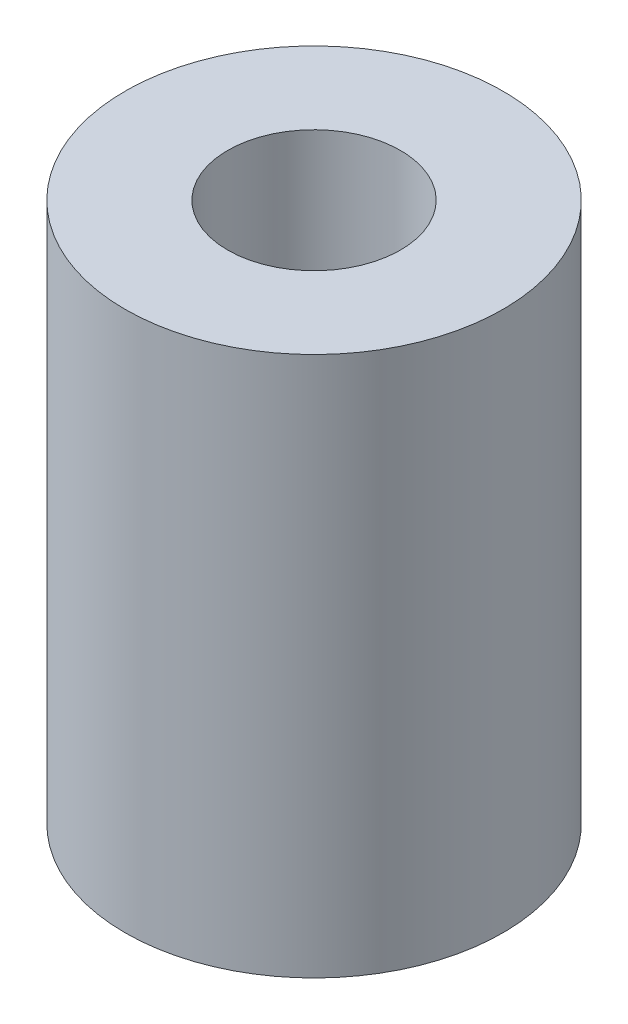
ISO-10303-21;
HEADER;
FILE_DESCRIPTION(('STEP AP214'),'2;1');
FILE_NAME('part.step','',(''),(''),'','','');
FILE_SCHEMA(('AUTOMOTIVE_DESIGN { 1 0 10303 214 1 1 1 1 }'));
ENDSEC;
DATA;
#1=APPLICATION_CONTEXT('core data for automotive mechanical design processes');
#2=APPLICATION_PROTOCOL_DEFINITION('international standard','automotive_design',2000,#1);
#3=PRODUCT_CONTEXT('',#1,'mechanical');
#4=PRODUCT('Part','Part','',(#3));
#5=PRODUCT_RELATED_PRODUCT_CATEGORY('part','',(#4));
#6=PRODUCT_DEFINITION_FORMATION('','',#4);
#7=PRODUCT_DEFINITION_CONTEXT('part definition',#1,'design');
#8=PRODUCT_DEFINITION('design','',#6,#7);
#9=PRODUCT_DEFINITION_SHAPE('','',#8);
#10=(LENGTH_UNIT() NAMED_UNIT(*) SI_UNIT(.MILLI.,.METRE.));
#11=(NAMED_UNIT(*) PLANE_ANGLE_UNIT() SI_UNIT($,.RADIAN.));
#12=(NAMED_UNIT(*) SI_UNIT($,.STERADIAN.) SOLID_ANGLE_UNIT());
#13=UNCERTAINTY_MEASURE_WITH_UNIT(LENGTH_MEASURE(1.E-05),#10,'distance_accuracy_value','');
#14=(GEOMETRIC_REPRESENTATION_CONTEXT(3) GLOBAL_UNCERTAINTY_ASSIGNED_CONTEXT((#13)) GLOBAL_UNIT_ASSIGNED_CONTEXT((#10,
#11,#12)) REPRESENTATION_CONTEXT('',''));
#15=CARTESIAN_POINT('',(0.,0.,0.));
#16=DIRECTION('',(0.,0.,1.));
#17=DIRECTION('',(1.,0.,0.));
#18=AXIS2_PLACEMENT_3D('',#15,#16,#17);
#19=CARTESIAN_POINT('',(0.,5.,0.));
#20=DIRECTION('',(0.,1.,0.));
#21=DIRECTION('',(0.,0.,1.));
#22=AXIS2_PLACEMENT_3D('',#19,#20,#21);
#23=PLANE('',#22);
#24=CARTESIAN_POINT('',(0.,5.,0.));
#25=DIRECTION('',(0.,1.,0.));
#26=DIRECTION('',(0.,0.,1.));
#27=AXIS2_PLACEMENT_3D('',#24,#25,#26);
#28=CIRCLE('',#27,3.5);
#29=CARTESIAN_POINT('',(0.,5.,3.5));
#30=VERTEX_POINT('',#29);
#31=EDGE_CURVE('E10',#30,#30,#28,.T.);
#32=ORIENTED_EDGE('',*,*,#31,.T.);
#33=EDGE_LOOP('',(#32));
#34=FACE_BOUND('',#33,.T.);
#35=CARTESIAN_POINT('',(0.,5.,0.));
#36=DIRECTION('',(0.,1.,0.));
#37=DIRECTION('',(0.,0.,1.));
#38=AXIS2_PLACEMENT_3D('',#35,#36,#37);
#39=CIRCLE('',#38,1.6);
#40=CARTESIAN_POINT('',(0.,5.,1.6));
#41=VERTEX_POINT('',#40);
#42=EDGE_CURVE('E48',#41,#41,#39,.T.);
#43=ORIENTED_EDGE('',*,*,#42,.F.);
#44=EDGE_LOOP('',(#43));
#45=FACE_BOUND('',#44,.T.);
#46=ADVANCED_FACE('F37',(#34,#45),#23,.T.);
#47=CARTESIAN_POINT('',(0.,-5.,0.));
#48=DIRECTION('',(0.,1.,0.));
#49=DIRECTION('',(0.,0.,1.));
#50=AXIS2_PLACEMENT_3D('',#47,#48,#49);
#51=PLANE('',#50);
#52=CARTESIAN_POINT('',(0.,-5.,0.));
#53=DIRECTION('',(0.,1.,0.));
#54=DIRECTION('',(0.,0.,1.));
#55=AXIS2_PLACEMENT_3D('',#52,#53,#54);
#56=CIRCLE('',#55,3.5);
#57=CARTESIAN_POINT('',(0.,-5.,3.5));
#58=VERTEX_POINT('',#57);
#59=EDGE_CURVE('E41',#58,#58,#56,.T.);
#60=ORIENTED_EDGE('',*,*,#59,.F.);
#61=EDGE_LOOP('',(#60));
#62=FACE_BOUND('',#61,.T.);
#63=CARTESIAN_POINT('',(0.,-5.,0.));
#64=DIRECTION('',(0.,1.,0.));
#65=DIRECTION('',(0.,0.,1.));
#66=AXIS2_PLACEMENT_3D('',#63,#64,#65);
#67=CIRCLE('',#66,1.6);
#68=CARTESIAN_POINT('',(0.,-5.,1.6));
#69=VERTEX_POINT('',#68);
#70=EDGE_CURVE('E50',#69,#69,#67,.T.);
#71=ORIENTED_EDGE('',*,*,#70,.T.);
#72=EDGE_LOOP('',(#71));
#73=FACE_BOUND('',#72,.T.);
#74=ADVANCED_FACE('F60',(#62,#73),#51,.F.);
#75=CARTESIAN_POINT('',(0.,5.,0.));
#76=DIRECTION('',(0.,-1.,0.));
#77=DIRECTION('',(0.,0.,-1.));
#78=AXIS2_PLACEMENT_3D('',#75,#76,#77);
#79=CYLINDRICAL_SURFACE('',#78,3.5);
#80=ORIENTED_EDGE('',*,*,#31,.F.);
#81=EDGE_LOOP('',(#80));
#82=FACE_BOUND('',#81,.T.);
#83=ORIENTED_EDGE('',*,*,#59,.T.);
#84=EDGE_LOOP('',(#83));
#85=FACE_BOUND('',#84,.T.);
#86=ADVANCED_FACE('F39',(#82,#85),#79,.T.);
#87=CARTESIAN_POINT('',(0.,5.,0.));
#88=DIRECTION('',(0.,-1.,0.));
#89=DIRECTION('',(0.,0.,-1.));
#90=AXIS2_PLACEMENT_3D('',#87,#88,#89);
#91=CYLINDRICAL_SURFACE('',#90,1.6);
#92=ORIENTED_EDGE('',*,*,#42,.T.);
#93=EDGE_LOOP('',(#92));
#94=FACE_BOUND('',#93,.T.);
#95=ORIENTED_EDGE('',*,*,#70,.F.);
#96=EDGE_LOOP('',(#95));
#97=FACE_BOUND('',#96,.T.);
#98=ADVANCED_FACE('F56',(#94,#97),#91,.F.);
#99=CLOSED_SHELL('',(#46,#74,#86,#98));
#100=MANIFOLD_SOLID_BREP('B2',#99);
#101=ADVANCED_BREP_SHAPE_REPRESENTATION('',(#18,#100),#14);
#102=SHAPE_DEFINITION_REPRESENTATION(#9,#101);
ENDSEC;
END-ISO-10303-21;
